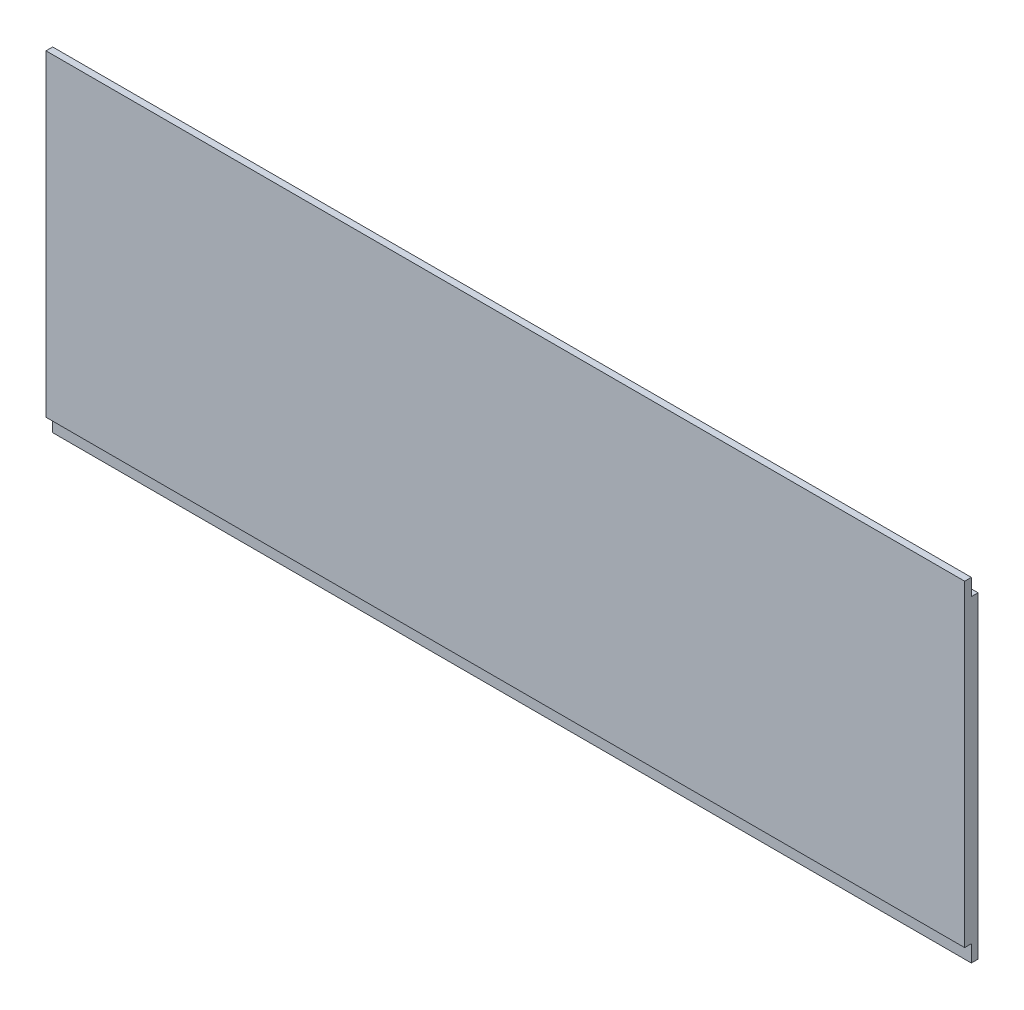
ISO-10303-21;
HEADER;
FILE_DESCRIPTION(('STEP AP214'),'2;1');
FILE_NAME('part.step','',(''),(''),'','','');
FILE_SCHEMA(('AUTOMOTIVE_DESIGN { 1 0 10303 214 1 1 1 1 }'));
ENDSEC;
DATA;
#1=APPLICATION_CONTEXT('core data for automotive mechanical design processes');
#2=APPLICATION_PROTOCOL_DEFINITION('international standard','automotive_design',2000,#1);
#3=PRODUCT_CONTEXT('',#1,'mechanical');
#4=PRODUCT('Part','Part','',(#3));
#5=PRODUCT_RELATED_PRODUCT_CATEGORY('part','',(#4));
#6=PRODUCT_DEFINITION_FORMATION('','',#4);
#7=PRODUCT_DEFINITION_CONTEXT('part definition',#1,'design');
#8=PRODUCT_DEFINITION('design','',#6,#7);
#9=PRODUCT_DEFINITION_SHAPE('','',#8);
#10=(LENGTH_UNIT() NAMED_UNIT(*) SI_UNIT(.MILLI.,.METRE.));
#11=(NAMED_UNIT(*) PLANE_ANGLE_UNIT() SI_UNIT($,.RADIAN.));
#12=(NAMED_UNIT(*) SI_UNIT($,.STERADIAN.) SOLID_ANGLE_UNIT());
#13=UNCERTAINTY_MEASURE_WITH_UNIT(LENGTH_MEASURE(1.E-05),#10,'distance_accuracy_value','');
#14=(GEOMETRIC_REPRESENTATION_CONTEXT(3) GLOBAL_UNCERTAINTY_ASSIGNED_CONTEXT((#13)) GLOBAL_UNIT_ASSIGNED_CONTEXT((#10,
#11,#12)) REPRESENTATION_CONTEXT('',''));
#15=CARTESIAN_POINT('',(0.,0.,0.));
#16=DIRECTION('',(0.,0.,1.));
#17=DIRECTION('',(1.,0.,0.));
#18=AXIS2_PLACEMENT_3D('',#15,#16,#17);
#19=CARTESIAN_POINT('',(550.,0.,4.));
#20=DIRECTION('',(0.,1.,0.));
#21=DIRECTION('',(0.,0.,1.));
#22=AXIS2_PLACEMENT_3D('',#19,#20,#21);
#23=PLANE('',#22);
#24=DIRECTION('',(0.,0.,-1.));
#25=VECTOR('',#24,1.);
#26=CARTESIAN_POINT('',(0.,0.,4.));
#27=LINE('',#26,#25);
#28=CARTESIAN_POINT('',(0.,0.,4.));
#29=VERTEX_POINT('',#28);
#30=CARTESIAN_POINT('',(0.,0.,0.));
#31=VERTEX_POINT('',#30);
#32=EDGE_CURVE('E132',#29,#31,#27,.T.);
#33=ORIENTED_EDGE('',*,*,#32,.T.);
#34=DIRECTION('',(-1.,0.,0.));
#35=VECTOR('',#34,1.);
#36=CARTESIAN_POINT('',(550.,0.,0.));
#37=LINE('',#36,#35);
#38=CARTESIAN_POINT('',(550.,0.,0.));
#39=VERTEX_POINT('',#38);
#40=EDGE_CURVE('E11',#39,#31,#37,.T.);
#41=ORIENTED_EDGE('',*,*,#40,.F.);
#42=DIRECTION('',(0.,0.,-1.));
#43=VECTOR('',#42,1.);
#44=CARTESIAN_POINT('',(550.,0.,4.));
#45=LINE('',#44,#43);
#46=CARTESIAN_POINT('',(550.,0.,4.));
#47=VERTEX_POINT('',#46);
#48=EDGE_CURVE('E146',#47,#39,#45,.T.);
#49=ORIENTED_EDGE('',*,*,#48,.F.);
#50=DIRECTION('',(-1.,0.,0.));
#51=VECTOR('',#50,1.);
#52=CARTESIAN_POINT('',(550.,0.,4.));
#53=LINE('',#52,#51);
#54=EDGE_CURVE('E128',#47,#29,#53,.T.);
#55=ORIENTED_EDGE('',*,*,#54,.T.);
#56=EDGE_LOOP('',(#33,#41,#49,#55));
#57=FACE_BOUND('',#56,.T.);
#58=ADVANCED_FACE('F36',(#57),#23,.F.);
#59=CARTESIAN_POINT('',(550.,0.,0.));
#60=DIRECTION('',(0.,0.,1.));
#61=DIRECTION('',(1.,0.,0.));
#62=AXIS2_PLACEMENT_3D('',#59,#60,#61);
#63=PLANE('',#62);
#64=DIRECTION('',(0.,1.,0.));
#65=VECTOR('',#64,1.);
#66=CARTESIAN_POINT('',(0.,0.,0.));
#67=LINE('',#66,#65);
#68=CARTESIAN_POINT('',(0.,190.,0.));
#69=VERTEX_POINT('',#68);
#70=EDGE_CURVE('E135',#31,#69,#67,.T.);
#71=ORIENTED_EDGE('',*,*,#70,.T.);
#72=DIRECTION('',(-1.,0.,0.));
#73=VECTOR('',#72,1.);
#74=CARTESIAN_POINT('',(550.,190.,0.));
#75=LINE('',#74,#73);
#76=CARTESIAN_POINT('',(550.,190.,0.));
#77=VERTEX_POINT('',#76);
#78=EDGE_CURVE('E44',#77,#69,#75,.T.);
#79=ORIENTED_EDGE('',*,*,#78,.F.);
#80=DIRECTION('',(0.,1.,0.));
#81=VECTOR('',#80,1.);
#82=CARTESIAN_POINT('',(550.,0.,0.));
#83=LINE('',#82,#81);
#84=EDGE_CURVE('E95',#39,#77,#83,.T.);
#85=ORIENTED_EDGE('',*,*,#84,.F.);
#86=ORIENTED_EDGE('',*,*,#40,.T.);
#87=EDGE_LOOP('',(#71,#79,#85,#86));
#88=FACE_BOUND('',#87,.T.);
#89=ADVANCED_FACE('F181',(#88),#63,.F.);
#90=CARTESIAN_POINT('',(550.,190.,0.));
#91=DIRECTION('',(0.,-1.,0.));
#92=DIRECTION('',(0.,0.,-1.));
#93=AXIS2_PLACEMENT_3D('',#90,#91,#92);
#94=PLANE('',#93);
#95=DIRECTION('',(0.,0.,1.));
#96=VECTOR('',#95,1.);
#97=CARTESIAN_POINT('',(0.,190.,0.));
#98=LINE('',#97,#96);
#99=CARTESIAN_POINT('',(0.,190.,4.));
#100=VERTEX_POINT('',#99);
#101=EDGE_CURVE('E137',#69,#100,#98,.T.);
#102=ORIENTED_EDGE('',*,*,#101,.T.);
#103=DIRECTION('',(-1.,0.,0.));
#104=VECTOR('',#103,1.);
#105=CARTESIAN_POINT('',(550.,190.,4.));
#106=LINE('',#105,#104);
#107=CARTESIAN_POINT('',(550.,190.,4.));
#108=VERTEX_POINT('',#107);
#109=EDGE_CURVE('E153',#108,#100,#106,.T.);
#110=ORIENTED_EDGE('',*,*,#109,.F.);
#111=DIRECTION('',(0.,0.,1.));
#112=VECTOR('',#111,1.);
#113=CARTESIAN_POINT('',(550.,190.,0.));
#114=LINE('',#113,#112);
#115=EDGE_CURVE('E161',#77,#108,#114,.T.);
#116=ORIENTED_EDGE('',*,*,#115,.F.);
#117=ORIENTED_EDGE('',*,*,#78,.T.);
#118=EDGE_LOOP('',(#102,#110,#116,#117));
#119=FACE_BOUND('',#118,.T.);
#120=ADVANCED_FACE('F159',(#119),#94,.F.);
#121=CARTESIAN_POINT('',(550.,190.,4.));
#122=DIRECTION('',(0.,0.,1.));
#123=DIRECTION('',(1.,0.,0.));
#124=AXIS2_PLACEMENT_3D('',#121,#122,#123);
#125=PLANE('',#124);
#126=DIRECTION('',(0.,1.,0.));
#127=VECTOR('',#126,1.);
#128=CARTESIAN_POINT('',(0.,190.,4.));
#129=LINE('',#128,#127);
#130=CARTESIAN_POINT('',(0.,200.,4.));
#131=VERTEX_POINT('',#130);
#132=EDGE_CURVE('E139',#100,#131,#129,.T.);
#133=ORIENTED_EDGE('',*,*,#132,.T.);
#134=DIRECTION('',(-1.,0.,0.));
#135=VECTOR('',#134,1.);
#136=CARTESIAN_POINT('',(550.,200.,4.));
#137=LINE('',#136,#135);
#138=CARTESIAN_POINT('',(550.,200.,4.));
#139=VERTEX_POINT('',#138);
#140=EDGE_CURVE('E150',#139,#131,#137,.T.);
#141=ORIENTED_EDGE('',*,*,#140,.F.);
#142=DIRECTION('',(0.,1.,0.));
#143=VECTOR('',#142,1.);
#144=CARTESIAN_POINT('',(550.,190.,4.));
#145=LINE('',#144,#143);
#146=EDGE_CURVE('E173',#108,#139,#145,.T.);
#147=ORIENTED_EDGE('',*,*,#146,.F.);
#148=ORIENTED_EDGE('',*,*,#109,.T.);
#149=EDGE_LOOP('',(#133,#141,#147,#148));
#150=FACE_BOUND('',#149,.T.);
#151=ADVANCED_FACE('F169',(#150),#125,.F.);
#152=CARTESIAN_POINT('',(550.,200.,4.));
#153=DIRECTION('',(0.,-1.,0.));
#154=DIRECTION('',(0.,0.,-1.));
#155=AXIS2_PLACEMENT_3D('',#152,#153,#154);
#156=PLANE('',#155);
#157=DIRECTION('',(0.,0.,1.));
#158=VECTOR('',#157,1.);
#159=CARTESIAN_POINT('',(0.,200.,4.));
#160=LINE('',#159,#158);
#161=CARTESIAN_POINT('',(0.,200.,8.00000000000002));
#162=VERTEX_POINT('',#161);
#163=EDGE_CURVE('E141',#131,#162,#160,.T.);
#164=ORIENTED_EDGE('',*,*,#163,.T.);
#165=DIRECTION('',(-1.,0.,0.));
#166=VECTOR('',#165,1.);
#167=CARTESIAN_POINT('',(550.,200.,8.00000000000002));
#168=LINE('',#167,#166);
#169=CARTESIAN_POINT('',(550.,200.,8.00000000000002));
#170=VERTEX_POINT('',#169);
#171=EDGE_CURVE('E123',#170,#162,#168,.T.);
#172=ORIENTED_EDGE('',*,*,#171,.F.);
#173=DIRECTION('',(0.,0.,1.));
#174=VECTOR('',#173,1.);
#175=CARTESIAN_POINT('',(550.,200.,4.));
#176=LINE('',#175,#174);
#177=EDGE_CURVE('E114',#139,#170,#176,.T.);
#178=ORIENTED_EDGE('',*,*,#177,.F.);
#179=ORIENTED_EDGE('',*,*,#140,.T.);
#180=EDGE_LOOP('',(#164,#172,#178,#179));
#181=FACE_BOUND('',#180,.T.);
#182=ADVANCED_FACE('F172',(#181),#156,.F.);
#183=CARTESIAN_POINT('',(550.,200.,8.00000000000002));
#184=DIRECTION('',(0.,0.,-1.));
#185=DIRECTION('',(0.,1.,0.));
#186=AXIS2_PLACEMENT_3D('',#183,#184,#185);
#187=PLANE('',#186);
#188=DIRECTION('',(0.,-1.,0.));
#189=VECTOR('',#188,1.);
#190=CARTESIAN_POINT('',(0.,200.,8.00000000000002));
#191=LINE('',#190,#189);
#192=CARTESIAN_POINT('',(0.,10.,8.));
#193=VERTEX_POINT('',#192);
#194=EDGE_CURVE('E122',#162,#193,#191,.T.);
#195=ORIENTED_EDGE('',*,*,#194,.T.);
#196=DIRECTION('',(-1.,0.,0.));
#197=VECTOR('',#196,1.);
#198=CARTESIAN_POINT('',(550.,10.,8.));
#199=LINE('',#198,#197);
#200=CARTESIAN_POINT('',(550.,10.,8.));
#201=VERTEX_POINT('',#200);
#202=EDGE_CURVE('E119',#201,#193,#199,.T.);
#203=ORIENTED_EDGE('',*,*,#202,.F.);
#204=DIRECTION('',(0.,-1.,0.));
#205=VECTOR('',#204,1.);
#206=CARTESIAN_POINT('',(550.,200.,8.00000000000002));
#207=LINE('',#206,#205);
#208=EDGE_CURVE('E108',#170,#201,#207,.T.);
#209=ORIENTED_EDGE('',*,*,#208,.F.);
#210=ORIENTED_EDGE('',*,*,#171,.T.);
#211=EDGE_LOOP('',(#195,#203,#209,#210));
#212=FACE_BOUND('',#211,.T.);
#213=ADVANCED_FACE('F120',(#212),#187,.F.);
#214=CARTESIAN_POINT('',(550.,10.,8.));
#215=DIRECTION('',(0.,1.,0.));
#216=DIRECTION('',(0.,0.,1.));
#217=AXIS2_PLACEMENT_3D('',#214,#215,#216);
#218=PLANE('',#217);
#219=DIRECTION('',(0.,0.,-1.));
#220=VECTOR('',#219,1.);
#221=CARTESIAN_POINT('',(0.,10.,8.));
#222=LINE('',#221,#220);
#223=CARTESIAN_POINT('',(0.,10.,4.));
#224=VERTEX_POINT('',#223);
#225=EDGE_CURVE('E81',#193,#224,#222,.T.);
#226=ORIENTED_EDGE('',*,*,#225,.T.);
#227=DIRECTION('',(-1.,0.,0.));
#228=VECTOR('',#227,1.);
#229=CARTESIAN_POINT('',(550.,10.,4.));
#230=LINE('',#229,#228);
#231=CARTESIAN_POINT('',(550.,10.,4.));
#232=VERTEX_POINT('',#231);
#233=EDGE_CURVE('E124',#232,#224,#230,.T.);
#234=ORIENTED_EDGE('',*,*,#233,.F.);
#235=DIRECTION('',(0.,0.,-1.));
#236=VECTOR('',#235,1.);
#237=CARTESIAN_POINT('',(550.,10.,8.));
#238=LINE('',#237,#236);
#239=EDGE_CURVE('E112',#201,#232,#238,.T.);
#240=ORIENTED_EDGE('',*,*,#239,.F.);
#241=ORIENTED_EDGE('',*,*,#202,.T.);
#242=EDGE_LOOP('',(#226,#234,#240,#241));
#243=FACE_BOUND('',#242,.T.);
#244=ADVANCED_FACE('F126',(#243),#218,.F.);
#245=CARTESIAN_POINT('',(550.,10.,4.));
#246=DIRECTION('',(0.,0.,-1.));
#247=DIRECTION('',(0.,1.,0.));
#248=AXIS2_PLACEMENT_3D('',#245,#246,#247);
#249=PLANE('',#248);
#250=DIRECTION('',(0.,-1.,0.));
#251=VECTOR('',#250,1.);
#252=CARTESIAN_POINT('',(0.,10.,4.));
#253=LINE('',#252,#251);
#254=EDGE_CURVE('E87',#224,#29,#253,.T.);
#255=ORIENTED_EDGE('',*,*,#254,.T.);
#256=ORIENTED_EDGE('',*,*,#54,.F.);
#257=DIRECTION('',(0.,-1.,0.));
#258=VECTOR('',#257,1.);
#259=CARTESIAN_POINT('',(550.,10.,4.));
#260=LINE('',#259,#258);
#261=EDGE_CURVE('E52',#232,#47,#260,.T.);
#262=ORIENTED_EDGE('',*,*,#261,.F.);
#263=ORIENTED_EDGE('',*,*,#233,.T.);
#264=EDGE_LOOP('',(#255,#256,#262,#263));
#265=FACE_BOUND('',#264,.T.);
#266=ADVANCED_FACE('F197',(#265),#249,.F.);
#267=CARTESIAN_POINT('',(550.,0.,0.));
#268=DIRECTION('',(1.,0.,0.));
#269=DIRECTION('',(0.,0.,-1.));
#270=AXIS2_PLACEMENT_3D('',#267,#268,#269);
#271=PLANE('',#270);
#272=ORIENTED_EDGE('',*,*,#48,.T.);
#273=ORIENTED_EDGE('',*,*,#84,.T.);
#274=ORIENTED_EDGE('',*,*,#115,.T.);
#275=ORIENTED_EDGE('',*,*,#146,.T.);
#276=ORIENTED_EDGE('',*,*,#177,.T.);
#277=ORIENTED_EDGE('',*,*,#208,.T.);
#278=ORIENTED_EDGE('',*,*,#239,.T.);
#279=ORIENTED_EDGE('',*,*,#261,.T.);
#280=EDGE_LOOP('',(#272,#273,#274,#275,#276,#277,#278,#279));
#281=FACE_BOUND('',#280,.T.);
#282=ADVANCED_FACE('F110',(#281),#271,.T.);
#283=CARTESIAN_POINT('',(0.,0.,0.));
#284=DIRECTION('',(1.,0.,0.));
#285=DIRECTION('',(0.,0.,-1.));
#286=AXIS2_PLACEMENT_3D('',#283,#284,#285);
#287=PLANE('',#286);
#288=ORIENTED_EDGE('',*,*,#32,.F.);
#289=ORIENTED_EDGE('',*,*,#254,.F.);
#290=ORIENTED_EDGE('',*,*,#225,.F.);
#291=ORIENTED_EDGE('',*,*,#194,.F.);
#292=ORIENTED_EDGE('',*,*,#163,.F.);
#293=ORIENTED_EDGE('',*,*,#132,.F.);
#294=ORIENTED_EDGE('',*,*,#101,.F.);
#295=ORIENTED_EDGE('',*,*,#70,.F.);
#296=EDGE_LOOP('',(#288,#289,#290,#291,#292,#293,#294,#295));
#297=FACE_BOUND('',#296,.T.);
#298=ADVANCED_FACE('F165',(#297),#287,.F.);
#299=CLOSED_SHELL('',(#58,#89,#120,#151,#182,#213,#244,#266,#282,#298));
#300=MANIFOLD_SOLID_BREP('B2',#299);
#301=ADVANCED_BREP_SHAPE_REPRESENTATION('',(#18,#300),#14);
#302=SHAPE_DEFINITION_REPRESENTATION(#9,#301);
ENDSEC;
END-ISO-10303-21;
